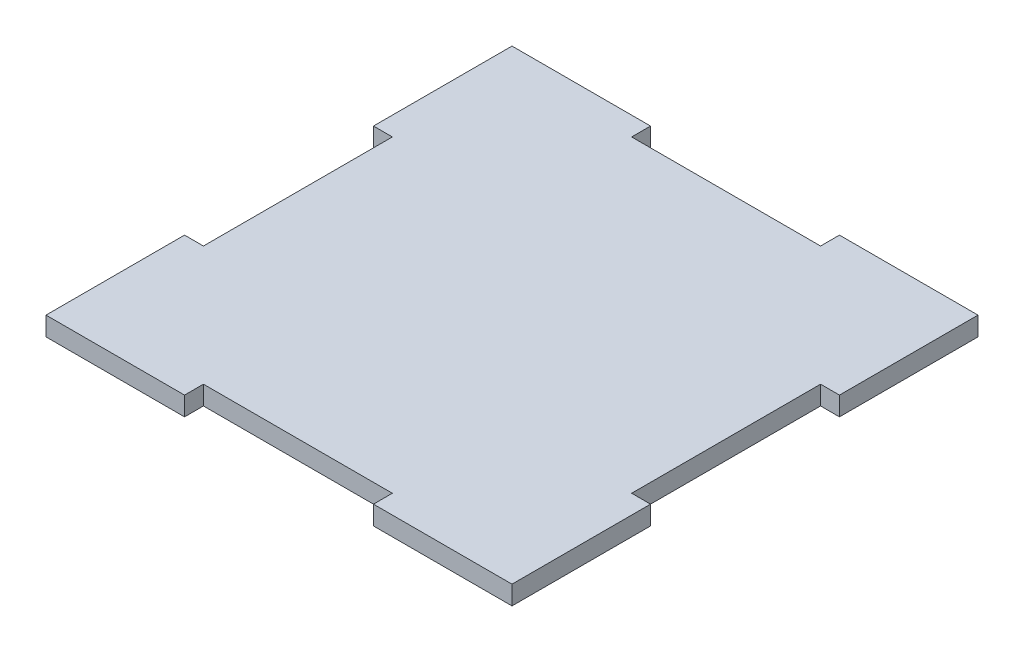
ISO-10303-21;
HEADER;
FILE_DESCRIPTION(('STEP AP214'),'2;1');
FILE_NAME('part.step','',(''),(''),'','','');
FILE_SCHEMA(('AUTOMOTIVE_DESIGN { 1 0 10303 214 1 1 1 1 }'));
ENDSEC;
DATA;
#1=APPLICATION_CONTEXT('core data for automotive mechanical design processes');
#2=APPLICATION_PROTOCOL_DEFINITION('international standard','automotive_design',2000,#1);
#3=PRODUCT_CONTEXT('',#1,'mechanical');
#4=PRODUCT('Part','Part','',(#3));
#5=PRODUCT_RELATED_PRODUCT_CATEGORY('part','',(#4));
#6=PRODUCT_DEFINITION_FORMATION('','',#4);
#7=PRODUCT_DEFINITION_CONTEXT('part definition',#1,'design');
#8=PRODUCT_DEFINITION('design','',#6,#7);
#9=PRODUCT_DEFINITION_SHAPE('','',#8);
#10=(LENGTH_UNIT() NAMED_UNIT(*) SI_UNIT(.MILLI.,.METRE.));
#11=(NAMED_UNIT(*) PLANE_ANGLE_UNIT() SI_UNIT($,.RADIAN.));
#12=(NAMED_UNIT(*) SI_UNIT($,.STERADIAN.) SOLID_ANGLE_UNIT());
#13=UNCERTAINTY_MEASURE_WITH_UNIT(LENGTH_MEASURE(1.E-05),#10,'distance_accuracy_value','');
#14=(GEOMETRIC_REPRESENTATION_CONTEXT(3) GLOBAL_UNCERTAINTY_ASSIGNED_CONTEXT((#13)) GLOBAL_UNIT_ASSIGNED_CONTEXT((#10,
#11,#12)) REPRESENTATION_CONTEXT('',''));
#15=CARTESIAN_POINT('',(0.,0.,0.));
#16=DIRECTION('',(0.,0.,1.));
#17=DIRECTION('',(1.,0.,0.));
#18=AXIS2_PLACEMENT_3D('',#15,#16,#17);
#19=CARTESIAN_POINT('',(37.,3.,-37.));
#20=DIRECTION('',(-1.,0.,0.));
#21=DIRECTION('',(0.,0.,1.));
#22=AXIS2_PLACEMENT_3D('',#19,#20,#21);
#23=PLANE('',#22);
#24=DIRECTION('',(0.,0.,-1.));
#25=VECTOR('',#24,1.);
#26=CARTESIAN_POINT('',(37.,0.,-37.));
#27=LINE('',#26,#25);
#28=CARTESIAN_POINT('',(37.,0.,37.));
#29=VERTEX_POINT('',#28);
#30=CARTESIAN_POINT('',(37.,0.,15.));
#31=VERTEX_POINT('',#30);
#32=EDGE_CURVE('E305',#29,#31,#27,.T.);
#33=ORIENTED_EDGE('',*,*,#32,.T.);
#34=DIRECTION('',(0.,1.,0.));
#35=VECTOR('',#34,1.);
#36=CARTESIAN_POINT('',(37.,0.,15.));
#37=LINE('',#36,#35);
#38=CARTESIAN_POINT('',(37.,3.,15.));
#39=VERTEX_POINT('',#38);
#40=EDGE_CURVE('E220',#31,#39,#37,.T.);
#41=ORIENTED_EDGE('',*,*,#40,.T.);
#42=DIRECTION('',(0.,0.,-1.));
#43=VECTOR('',#42,1.);
#44=CARTESIAN_POINT('',(37.,3.,-37.));
#45=LINE('',#44,#43);
#46=CARTESIAN_POINT('',(37.,3.,37.));
#47=VERTEX_POINT('',#46);
#48=EDGE_CURVE('E288',#47,#39,#45,.T.);
#49=ORIENTED_EDGE('',*,*,#48,.F.);
#50=DIRECTION('',(0.,-1.,0.));
#51=VECTOR('',#50,1.);
#52=CARTESIAN_POINT('',(37.,3.,37.));
#53=LINE('',#52,#51);
#54=EDGE_CURVE('E304',#47,#29,#53,.T.);
#55=ORIENTED_EDGE('',*,*,#54,.T.);
#56=EDGE_LOOP('',(#33,#41,#49,#55));
#57=FACE_BOUND('',#56,.T.);
#58=ADVANCED_FACE('F39',(#57),#23,.F.);
#59=CARTESIAN_POINT('',(-37.,3.,-37.));
#60=DIRECTION('',(0.,0.,1.));
#61=DIRECTION('',(1.,0.,0.));
#62=AXIS2_PLACEMENT_3D('',#59,#60,#61);
#63=PLANE('',#62);
#64=DIRECTION('',(-1.,0.,0.));
#65=VECTOR('',#64,1.);
#66=CARTESIAN_POINT('',(-37.,3.,-37.));
#67=LINE('',#66,#65);
#68=CARTESIAN_POINT('',(-15.,3.,-37.));
#69=VERTEX_POINT('',#68);
#70=CARTESIAN_POINT('',(-37.,3.,-37.));
#71=VERTEX_POINT('',#70);
#72=EDGE_CURVE('E291',#69,#71,#67,.T.);
#73=ORIENTED_EDGE('',*,*,#72,.F.);
#74=DIRECTION('',(0.,1.,0.));
#75=VECTOR('',#74,1.);
#76=CARTESIAN_POINT('',(-15.,0.,-37.));
#77=LINE('',#76,#75);
#78=CARTESIAN_POINT('',(-15.,0.,-37.));
#79=VERTEX_POINT('',#78);
#80=EDGE_CURVE('E206',#79,#69,#77,.T.);
#81=ORIENTED_EDGE('',*,*,#80,.F.);
#82=DIRECTION('',(-1.,0.,0.));
#83=VECTOR('',#82,1.);
#84=CARTESIAN_POINT('',(-37.,0.,-37.));
#85=LINE('',#84,#83);
#86=CARTESIAN_POINT('',(-37.,0.,-37.));
#87=VERTEX_POINT('',#86);
#88=EDGE_CURVE('E196',#79,#87,#85,.T.);
#89=ORIENTED_EDGE('',*,*,#88,.T.);
#90=DIRECTION('',(0.,-1.,0.));
#91=VECTOR('',#90,1.);
#92=CARTESIAN_POINT('',(-37.,3.,-37.));
#93=LINE('',#92,#91);
#94=EDGE_CURVE('E47',#71,#87,#93,.T.);
#95=ORIENTED_EDGE('',*,*,#94,.F.);
#96=EDGE_LOOP('',(#73,#81,#89,#95));
#97=FACE_BOUND('',#96,.T.);
#98=ADVANCED_FACE('F337',(#97),#63,.F.);
#99=CARTESIAN_POINT('',(-37.,3.,-37.));
#100=DIRECTION('',(1.,0.,0.));
#101=DIRECTION('',(0.,0.,-1.));
#102=AXIS2_PLACEMENT_3D('',#99,#100,#101);
#103=PLANE('',#102);
#104=DIRECTION('',(0.,0.,1.));
#105=VECTOR('',#104,1.);
#106=CARTESIAN_POINT('',(-37.,0.,-37.));
#107=LINE('',#106,#105);
#108=CARTESIAN_POINT('',(-37.,0.,-15.));
#109=VERTEX_POINT('',#108);
#110=EDGE_CURVE('E312',#87,#109,#107,.T.);
#111=ORIENTED_EDGE('',*,*,#110,.T.);
#112=DIRECTION('',(0.,1.,0.));
#113=VECTOR('',#112,1.);
#114=CARTESIAN_POINT('',(-37.,0.,-15.));
#115=LINE('',#114,#113);
#116=CARTESIAN_POINT('',(-37.,3.,-15.));
#117=VERTEX_POINT('',#116);
#118=EDGE_CURVE('E270',#109,#117,#115,.T.);
#119=ORIENTED_EDGE('',*,*,#118,.T.);
#120=DIRECTION('',(0.,0.,1.));
#121=VECTOR('',#120,1.);
#122=CARTESIAN_POINT('',(-37.,3.,-37.));
#123=LINE('',#122,#121);
#124=EDGE_CURVE('E297',#71,#117,#123,.T.);
#125=ORIENTED_EDGE('',*,*,#124,.F.);
#126=ORIENTED_EDGE('',*,*,#94,.T.);
#127=EDGE_LOOP('',(#111,#119,#125,#126));
#128=FACE_BOUND('',#127,.T.);
#129=ADVANCED_FACE('F327',(#128),#103,.F.);
#130=CARTESIAN_POINT('',(-37.,3.,37.));
#131=DIRECTION('',(0.,0.,-1.));
#132=DIRECTION('',(-1.,0.,0.));
#133=AXIS2_PLACEMENT_3D('',#130,#131,#132);
#134=PLANE('',#133);
#135=DIRECTION('',(1.,0.,0.));
#136=VECTOR('',#135,1.);
#137=CARTESIAN_POINT('',(-37.,0.,37.));
#138=LINE('',#137,#136);
#139=CARTESIAN_POINT('',(-37.,0.,37.));
#140=VERTEX_POINT('',#139);
#141=CARTESIAN_POINT('',(-15.,0.,37.));
#142=VERTEX_POINT('',#141);
#143=EDGE_CURVE('E316',#140,#142,#138,.T.);
#144=ORIENTED_EDGE('',*,*,#143,.T.);
#145=DIRECTION('',(0.,1.,0.));
#146=VECTOR('',#145,1.);
#147=CARTESIAN_POINT('',(-15.,0.,37.));
#148=LINE('',#147,#146);
#149=CARTESIAN_POINT('',(-15.,3.,37.));
#150=VERTEX_POINT('',#149);
#151=EDGE_CURVE('E237',#142,#150,#148,.T.);
#152=ORIENTED_EDGE('',*,*,#151,.T.);
#153=DIRECTION('',(1.,0.,0.));
#154=VECTOR('',#153,1.);
#155=CARTESIAN_POINT('',(-37.,3.,37.));
#156=LINE('',#155,#154);
#157=CARTESIAN_POINT('',(-37.,3.,37.));
#158=VERTEX_POINT('',#157);
#159=EDGE_CURVE('E301',#158,#150,#156,.T.);
#160=ORIENTED_EDGE('',*,*,#159,.F.);
#161=DIRECTION('',(0.,-1.,0.));
#162=VECTOR('',#161,1.);
#163=CARTESIAN_POINT('',(-37.,3.,37.));
#164=LINE('',#163,#162);
#165=EDGE_CURVE('E321',#158,#140,#164,.T.);
#166=ORIENTED_EDGE('',*,*,#165,.T.);
#167=EDGE_LOOP('',(#144,#152,#160,#166));
#168=FACE_BOUND('',#167,.T.);
#169=ADVANCED_FACE('F344',(#168),#134,.F.);
#170=CARTESIAN_POINT('',(37.,3.,-15.));
#171=VERTEX_POINT('',#170);
#172=CARTESIAN_POINT('',(37.,3.,-37.));
#173=VERTEX_POINT('',#172);
#174=EDGE_CURVE('E292',#171,#173,#45,.T.);
#175=ORIENTED_EDGE('',*,*,#174,.F.);
#176=DIRECTION('',(0.,1.,0.));
#177=VECTOR('',#176,1.);
#178=CARTESIAN_POINT('',(37.,0.,-15.));
#179=LINE('',#178,#177);
#180=CARTESIAN_POINT('',(37.,0.,-15.));
#181=VERTEX_POINT('',#180);
#182=EDGE_CURVE('E213',#181,#171,#179,.T.);
#183=ORIENTED_EDGE('',*,*,#182,.F.);
#184=CARTESIAN_POINT('',(37.,0.,-37.));
#185=VERTEX_POINT('',#184);
#186=EDGE_CURVE('E208',#181,#185,#27,.T.);
#187=ORIENTED_EDGE('',*,*,#186,.T.);
#188=DIRECTION('',(0.,-1.,0.));
#189=VECTOR('',#188,1.);
#190=CARTESIAN_POINT('',(37.,3.,-37.));
#191=LINE('',#190,#189);
#192=EDGE_CURVE('E11',#173,#185,#191,.T.);
#193=ORIENTED_EDGE('',*,*,#192,.F.);
#194=EDGE_LOOP('',(#175,#183,#187,#193));
#195=FACE_BOUND('',#194,.T.);
#196=ADVANCED_FACE('F41',(#195),#23,.F.);
#197=CARTESIAN_POINT('',(15.,0.,-37.));
#198=VERTEX_POINT('',#197);
#199=EDGE_CURVE('E308',#185,#198,#85,.T.);
#200=ORIENTED_EDGE('',*,*,#199,.T.);
#201=DIRECTION('',(0.,1.,0.));
#202=VECTOR('',#201,1.);
#203=CARTESIAN_POINT('',(15.,0.,-37.));
#204=LINE('',#203,#202);
#205=CARTESIAN_POINT('',(15.,3.,-37.));
#206=VERTEX_POINT('',#205);
#207=EDGE_CURVE('E209',#198,#206,#204,.T.);
#208=ORIENTED_EDGE('',*,*,#207,.T.);
#209=EDGE_CURVE('E293',#173,#206,#67,.T.);
#210=ORIENTED_EDGE('',*,*,#209,.F.);
#211=ORIENTED_EDGE('',*,*,#192,.T.);
#212=EDGE_LOOP('',(#200,#208,#210,#211));
#213=FACE_BOUND('',#212,.T.);
#214=ADVANCED_FACE('F339',(#213),#63,.F.);
#215=CARTESIAN_POINT('',(-37.,3.,15.));
#216=VERTEX_POINT('',#215);
#217=EDGE_CURVE('E296',#216,#158,#123,.T.);
#218=ORIENTED_EDGE('',*,*,#217,.F.);
#219=DIRECTION('',(0.,1.,0.));
#220=VECTOR('',#219,1.);
#221=CARTESIAN_POINT('',(-37.,0.,15.));
#222=LINE('',#221,#220);
#223=CARTESIAN_POINT('',(-37.,0.,15.));
#224=VERTEX_POINT('',#223);
#225=EDGE_CURVE('E263',#224,#216,#222,.T.);
#226=ORIENTED_EDGE('',*,*,#225,.F.);
#227=EDGE_CURVE('E311',#224,#140,#107,.T.);
#228=ORIENTED_EDGE('',*,*,#227,.T.);
#229=ORIENTED_EDGE('',*,*,#165,.F.);
#230=EDGE_LOOP('',(#218,#226,#228,#229));
#231=FACE_BOUND('',#230,.T.);
#232=ADVANCED_FACE('F346',(#231),#103,.F.);
#233=CARTESIAN_POINT('',(15.,3.,37.));
#234=VERTEX_POINT('',#233);
#235=EDGE_CURVE('E300',#234,#47,#156,.T.);
#236=ORIENTED_EDGE('',*,*,#235,.F.);
#237=DIRECTION('',(0.,1.,0.));
#238=VECTOR('',#237,1.);
#239=CARTESIAN_POINT('',(15.,0.,37.));
#240=LINE('',#239,#238);
#241=CARTESIAN_POINT('',(15.,0.,37.));
#242=VERTEX_POINT('',#241);
#243=EDGE_CURVE('E241',#242,#234,#240,.T.);
#244=ORIENTED_EDGE('',*,*,#243,.F.);
#245=EDGE_CURVE('E315',#242,#29,#138,.T.);
#246=ORIENTED_EDGE('',*,*,#245,.T.);
#247=ORIENTED_EDGE('',*,*,#54,.F.);
#248=EDGE_LOOP('',(#236,#244,#246,#247));
#249=FACE_BOUND('',#248,.T.);
#250=ADVANCED_FACE('F354',(#249),#134,.F.);
#251=CARTESIAN_POINT('',(0.,3.,0.));
#252=DIRECTION('',(0.,1.,0.));
#253=DIRECTION('',(0.,0.,1.));
#254=AXIS2_PLACEMENT_3D('',#251,#252,#253);
#255=PLANE('',#254);
#256=DIRECTION('',(0.,0.,1.));
#257=VECTOR('',#256,1.);
#258=CARTESIAN_POINT('',(-15.,3.,-37.));
#259=LINE('',#258,#257);
#260=CARTESIAN_POINT('',(-15.,3.,-34.));
#261=VERTEX_POINT('',#260);
#262=EDGE_CURVE('E182',#69,#261,#259,.T.);
#263=ORIENTED_EDGE('',*,*,#262,.F.);
#264=ORIENTED_EDGE('',*,*,#72,.T.);
#265=ORIENTED_EDGE('',*,*,#124,.T.);
#266=DIRECTION('',(-1.,0.,0.));
#267=VECTOR('',#266,1.);
#268=CARTESIAN_POINT('',(-37.,3.,-15.));
#269=LINE('',#268,#267);
#270=CARTESIAN_POINT('',(-34.,3.,-15.));
#271=VERTEX_POINT('',#270);
#272=EDGE_CURVE('E273',#271,#117,#269,.T.);
#273=ORIENTED_EDGE('',*,*,#272,.F.);
#274=DIRECTION('',(0.,0.,-1.));
#275=VECTOR('',#274,1.);
#276=CARTESIAN_POINT('',(-34.,3.,-15.));
#277=LINE('',#276,#275);
#278=CARTESIAN_POINT('',(-34.,3.,15.));
#279=VERTEX_POINT('',#278);
#280=EDGE_CURVE('E275',#279,#271,#277,.T.);
#281=ORIENTED_EDGE('',*,*,#280,.F.);
#282=DIRECTION('',(1.,0.,0.));
#283=VECTOR('',#282,1.);
#284=CARTESIAN_POINT('',(-37.,3.,15.));
#285=LINE('',#284,#283);
#286=EDGE_CURVE('E247',#216,#279,#285,.T.);
#287=ORIENTED_EDGE('',*,*,#286,.F.);
#288=ORIENTED_EDGE('',*,*,#217,.T.);
#289=ORIENTED_EDGE('',*,*,#159,.T.);
#290=DIRECTION('',(0.,0.,1.));
#291=VECTOR('',#290,1.);
#292=CARTESIAN_POINT('',(-15.,3.,37.));
#293=LINE('',#292,#291);
#294=CARTESIAN_POINT('',(-15.,3.,34.));
#295=VERTEX_POINT('',#294);
#296=EDGE_CURVE('E223',#295,#150,#293,.T.);
#297=ORIENTED_EDGE('',*,*,#296,.F.);
#298=DIRECTION('',(-1.,0.,0.));
#299=VECTOR('',#298,1.);
#300=CARTESIAN_POINT('',(-15.,3.,34.));
#301=LINE('',#300,#299);
#302=CARTESIAN_POINT('',(15.,3.,34.));
#303=VERTEX_POINT('',#302);
#304=EDGE_CURVE('E248',#303,#295,#301,.T.);
#305=ORIENTED_EDGE('',*,*,#304,.F.);
#306=DIRECTION('',(0.,0.,-1.));
#307=VECTOR('',#306,1.);
#308=CARTESIAN_POINT('',(15.,3.,37.));
#309=LINE('',#308,#307);
#310=EDGE_CURVE('E251',#234,#303,#309,.T.);
#311=ORIENTED_EDGE('',*,*,#310,.F.);
#312=ORIENTED_EDGE('',*,*,#235,.T.);
#313=ORIENTED_EDGE('',*,*,#48,.T.);
#314=DIRECTION('',(1.,0.,0.));
#315=VECTOR('',#314,1.);
#316=CARTESIAN_POINT('',(37.,3.,15.));
#317=LINE('',#316,#315);
#318=CARTESIAN_POINT('',(34.,3.,15.));
#319=VERTEX_POINT('',#318);
#320=EDGE_CURVE('E224',#319,#39,#317,.T.);
#321=ORIENTED_EDGE('',*,*,#320,.F.);
#322=DIRECTION('',(0.,0.,1.));
#323=VECTOR('',#322,1.);
#324=CARTESIAN_POINT('',(34.,3.,-15.));
#325=LINE('',#324,#323);
#326=CARTESIAN_POINT('',(34.,3.,-15.));
#327=VERTEX_POINT('',#326);
#328=EDGE_CURVE('E226',#327,#319,#325,.T.);
#329=ORIENTED_EDGE('',*,*,#328,.F.);
#330=DIRECTION('',(-1.,0.,0.));
#331=VECTOR('',#330,1.);
#332=CARTESIAN_POINT('',(37.,3.,-15.));
#333=LINE('',#332,#331);
#334=EDGE_CURVE('E204',#171,#327,#333,.T.);
#335=ORIENTED_EDGE('',*,*,#334,.F.);
#336=ORIENTED_EDGE('',*,*,#174,.T.);
#337=ORIENTED_EDGE('',*,*,#209,.T.);
#338=DIRECTION('',(0.,0.,-1.));
#339=VECTOR('',#338,1.);
#340=CARTESIAN_POINT('',(15.,3.,-37.));
#341=LINE('',#340,#339);
#342=CARTESIAN_POINT('',(15.,3.,-34.));
#343=VERTEX_POINT('',#342);
#344=EDGE_CURVE('E197',#343,#206,#341,.T.);
#345=ORIENTED_EDGE('',*,*,#344,.F.);
#346=DIRECTION('',(1.,0.,0.));
#347=VECTOR('',#346,1.);
#348=CARTESIAN_POINT('',(-15.,3.,-34.));
#349=LINE('',#348,#347);
#350=EDGE_CURVE('E199',#261,#343,#349,.T.);
#351=ORIENTED_EDGE('',*,*,#350,.F.);
#352=EDGE_LOOP('',(#263,#264,#265,#273,#281,#287,#288,#289,#297,#305,#311,#312,#313,#321,#329,
#335,#336,#337,#345,#351));
#353=FACE_BOUND('',#352,.T.);
#354=ADVANCED_FACE('F335',(#353),#255,.T.);
#355=CARTESIAN_POINT('',(0.,0.,0.));
#356=DIRECTION('',(0.,1.,0.));
#357=DIRECTION('',(0.,0.,1.));
#358=AXIS2_PLACEMENT_3D('',#355,#356,#357);
#359=PLANE('',#358);
#360=ORIENTED_EDGE('',*,*,#88,.F.);
#361=DIRECTION('',(0.,0.,1.));
#362=VECTOR('',#361,1.);
#363=CARTESIAN_POINT('',(-15.,0.,-37.));
#364=LINE('',#363,#362);
#365=CARTESIAN_POINT('',(-15.,0.,-34.));
#366=VERTEX_POINT('',#365);
#367=EDGE_CURVE('E179',#79,#366,#364,.T.);
#368=ORIENTED_EDGE('',*,*,#367,.T.);
#369=DIRECTION('',(1.,0.,0.));
#370=VECTOR('',#369,1.);
#371=CARTESIAN_POINT('',(-15.,0.,-34.));
#372=LINE('',#371,#370);
#373=CARTESIAN_POINT('',(15.,0.,-34.));
#374=VERTEX_POINT('',#373);
#375=EDGE_CURVE('E189',#366,#374,#372,.T.);
#376=ORIENTED_EDGE('',*,*,#375,.T.);
#377=DIRECTION('',(0.,0.,-1.));
#378=VECTOR('',#377,1.);
#379=CARTESIAN_POINT('',(15.,0.,-37.));
#380=LINE('',#379,#378);
#381=EDGE_CURVE('E54',#374,#198,#380,.T.);
#382=ORIENTED_EDGE('',*,*,#381,.T.);
#383=ORIENTED_EDGE('',*,*,#199,.F.);
#384=ORIENTED_EDGE('',*,*,#186,.F.);
#385=DIRECTION('',(-1.,0.,0.));
#386=VECTOR('',#385,1.);
#387=CARTESIAN_POINT('',(37.,0.,-15.));
#388=LINE('',#387,#386);
#389=CARTESIAN_POINT('',(34.,0.,-15.));
#390=VERTEX_POINT('',#389);
#391=EDGE_CURVE('E227',#181,#390,#388,.T.);
#392=ORIENTED_EDGE('',*,*,#391,.T.);
#393=DIRECTION('',(0.,0.,1.));
#394=VECTOR('',#393,1.);
#395=CARTESIAN_POINT('',(34.,0.,-15.));
#396=LINE('',#395,#394);
#397=CARTESIAN_POINT('',(34.,0.,15.));
#398=VERTEX_POINT('',#397);
#399=EDGE_CURVE('E62',#390,#398,#396,.T.);
#400=ORIENTED_EDGE('',*,*,#399,.T.);
#401=DIRECTION('',(1.,0.,0.));
#402=VECTOR('',#401,1.);
#403=CARTESIAN_POINT('',(37.,0.,15.));
#404=LINE('',#403,#402);
#405=EDGE_CURVE('E215',#398,#31,#404,.T.);
#406=ORIENTED_EDGE('',*,*,#405,.T.);
#407=ORIENTED_EDGE('',*,*,#32,.F.);
#408=ORIENTED_EDGE('',*,*,#245,.F.);
#409=DIRECTION('',(0.,0.,-1.));
#410=VECTOR('',#409,1.);
#411=CARTESIAN_POINT('',(15.,0.,37.));
#412=LINE('',#411,#410);
#413=CARTESIAN_POINT('',(15.,0.,34.));
#414=VERTEX_POINT('',#413);
#415=EDGE_CURVE('E258',#242,#414,#412,.T.);
#416=ORIENTED_EDGE('',*,*,#415,.T.);
#417=DIRECTION('',(-1.,0.,0.));
#418=VECTOR('',#417,1.);
#419=CARTESIAN_POINT('',(-15.,0.,34.));
#420=LINE('',#419,#418);
#421=CARTESIAN_POINT('',(-15.,0.,34.));
#422=VERTEX_POINT('',#421);
#423=EDGE_CURVE('E240',#414,#422,#420,.T.);
#424=ORIENTED_EDGE('',*,*,#423,.T.);
#425=DIRECTION('',(0.,0.,1.));
#426=VECTOR('',#425,1.);
#427=CARTESIAN_POINT('',(-15.,0.,37.));
#428=LINE('',#427,#426);
#429=EDGE_CURVE('E252',#422,#142,#428,.T.);
#430=ORIENTED_EDGE('',*,*,#429,.T.);
#431=ORIENTED_EDGE('',*,*,#143,.F.);
#432=ORIENTED_EDGE('',*,*,#227,.F.);
#433=DIRECTION('',(1.,0.,0.));
#434=VECTOR('',#433,1.);
#435=CARTESIAN_POINT('',(-37.,0.,15.));
#436=LINE('',#435,#434);
#437=CARTESIAN_POINT('',(-34.,0.,15.));
#438=VERTEX_POINT('',#437);
#439=EDGE_CURVE('E276',#224,#438,#436,.T.);
#440=ORIENTED_EDGE('',*,*,#439,.T.);
#441=DIRECTION('',(0.,0.,-1.));
#442=VECTOR('',#441,1.);
#443=CARTESIAN_POINT('',(-34.,0.,-15.));
#444=LINE('',#443,#442);
#445=CARTESIAN_POINT('',(-34.,0.,-15.));
#446=VERTEX_POINT('',#445);
#447=EDGE_CURVE('E283',#438,#446,#444,.T.);
#448=ORIENTED_EDGE('',*,*,#447,.T.);
#449=DIRECTION('',(-1.,0.,0.));
#450=VECTOR('',#449,1.);
#451=CARTESIAN_POINT('',(-37.,0.,-15.));
#452=LINE('',#451,#450);
#453=EDGE_CURVE('E265',#446,#109,#452,.T.);
#454=ORIENTED_EDGE('',*,*,#453,.T.);
#455=ORIENTED_EDGE('',*,*,#110,.F.);
#456=EDGE_LOOP('',(#360,#368,#376,#382,#383,#384,#392,#400,#406,#407,#408,#416,#424,#430,#431,
#432,#440,#448,#454,#455));
#457=FACE_BOUND('',#456,.T.);
#458=ADVANCED_FACE('F194',(#457),#359,.F.);
#459=CARTESIAN_POINT('',(-37.,0.,-15.));
#460=DIRECTION('',(0.,0.,-1.));
#461=DIRECTION('',(-1.,0.,0.));
#462=AXIS2_PLACEMENT_3D('',#459,#460,#461);
#463=PLANE('',#462);
#464=ORIENTED_EDGE('',*,*,#272,.T.);
#465=ORIENTED_EDGE('',*,*,#118,.F.);
#466=ORIENTED_EDGE('',*,*,#453,.F.);
#467=DIRECTION('',(0.,1.,0.));
#468=VECTOR('',#467,1.);
#469=CARTESIAN_POINT('',(-34.,0.,-15.));
#470=LINE('',#469,#468);
#471=EDGE_CURVE('E268',#446,#271,#470,.T.);
#472=ORIENTED_EDGE('',*,*,#471,.T.);
#473=EDGE_LOOP('',(#464,#465,#466,#472));
#474=FACE_BOUND('',#473,.T.);
#475=ADVANCED_FACE('F332',(#474),#463,.F.);
#476=CARTESIAN_POINT('',(-34.,0.,-15.));
#477=DIRECTION('',(1.,0.,0.));
#478=DIRECTION('',(0.,0.,-1.));
#479=AXIS2_PLACEMENT_3D('',#476,#477,#478);
#480=PLANE('',#479);
#481=ORIENTED_EDGE('',*,*,#280,.T.);
#482=ORIENTED_EDGE('',*,*,#471,.F.);
#483=ORIENTED_EDGE('',*,*,#447,.F.);
#484=DIRECTION('',(0.,1.,0.));
#485=VECTOR('',#484,1.);
#486=CARTESIAN_POINT('',(-34.,0.,15.));
#487=LINE('',#486,#485);
#488=EDGE_CURVE('E266',#438,#279,#487,.T.);
#489=ORIENTED_EDGE('',*,*,#488,.T.);
#490=EDGE_LOOP('',(#481,#482,#483,#489));
#491=FACE_BOUND('',#490,.T.);
#492=ADVANCED_FACE('F402',(#491),#480,.F.);
#493=CARTESIAN_POINT('',(-37.,0.,15.));
#494=DIRECTION('',(0.,0.,1.));
#495=DIRECTION('',(1.,0.,0.));
#496=AXIS2_PLACEMENT_3D('',#493,#494,#495);
#497=PLANE('',#496);
#498=ORIENTED_EDGE('',*,*,#286,.T.);
#499=ORIENTED_EDGE('',*,*,#488,.F.);
#500=ORIENTED_EDGE('',*,*,#439,.F.);
#501=ORIENTED_EDGE('',*,*,#225,.T.);
#502=EDGE_LOOP('',(#498,#499,#500,#501));
#503=FACE_BOUND('',#502,.T.);
#504=ADVANCED_FACE('F399',(#503),#497,.F.);
#505=CARTESIAN_POINT('',(-15.,0.,37.));
#506=DIRECTION('',(-1.,0.,0.));
#507=DIRECTION('',(0.,0.,1.));
#508=AXIS2_PLACEMENT_3D('',#505,#506,#507);
#509=PLANE('',#508);
#510=ORIENTED_EDGE('',*,*,#296,.T.);
#511=ORIENTED_EDGE('',*,*,#151,.F.);
#512=ORIENTED_EDGE('',*,*,#429,.F.);
#513=DIRECTION('',(0.,1.,0.));
#514=VECTOR('',#513,1.);
#515=CARTESIAN_POINT('',(-15.,0.,34.));
#516=LINE('',#515,#514);
#517=EDGE_CURVE('E245',#422,#295,#516,.T.);
#518=ORIENTED_EDGE('',*,*,#517,.T.);
#519=EDGE_LOOP('',(#510,#511,#512,#518));
#520=FACE_BOUND('',#519,.T.);
#521=ADVANCED_FACE('F389',(#520),#509,.F.);
#522=CARTESIAN_POINT('',(-15.,0.,34.));
#523=DIRECTION('',(0.,0.,-1.));
#524=DIRECTION('',(-1.,0.,0.));
#525=AXIS2_PLACEMENT_3D('',#522,#523,#524);
#526=PLANE('',#525);
#527=ORIENTED_EDGE('',*,*,#304,.T.);
#528=ORIENTED_EDGE('',*,*,#517,.F.);
#529=ORIENTED_EDGE('',*,*,#423,.F.);
#530=DIRECTION('',(0.,1.,0.));
#531=VECTOR('',#530,1.);
#532=CARTESIAN_POINT('',(15.,0.,34.));
#533=LINE('',#532,#531);
#534=EDGE_CURVE('E243',#414,#303,#533,.T.);
#535=ORIENTED_EDGE('',*,*,#534,.T.);
#536=EDGE_LOOP('',(#527,#528,#529,#535));
#537=FACE_BOUND('',#536,.T.);
#538=ADVANCED_FACE('F385',(#537),#526,.F.);
#539=CARTESIAN_POINT('',(15.,0.,37.));
#540=DIRECTION('',(1.,0.,0.));
#541=DIRECTION('',(0.,0.,-1.));
#542=AXIS2_PLACEMENT_3D('',#539,#540,#541);
#543=PLANE('',#542);
#544=ORIENTED_EDGE('',*,*,#310,.T.);
#545=ORIENTED_EDGE('',*,*,#534,.F.);
#546=ORIENTED_EDGE('',*,*,#415,.F.);
#547=ORIENTED_EDGE('',*,*,#243,.T.);
#548=EDGE_LOOP('',(#544,#545,#546,#547));
#549=FACE_BOUND('',#548,.T.);
#550=ADVANCED_FACE('F381',(#549),#543,.F.);
#551=CARTESIAN_POINT('',(37.,0.,15.));
#552=DIRECTION('',(0.,0.,1.));
#553=DIRECTION('',(1.,0.,0.));
#554=AXIS2_PLACEMENT_3D('',#551,#552,#553);
#555=PLANE('',#554);
#556=ORIENTED_EDGE('',*,*,#320,.T.);
#557=ORIENTED_EDGE('',*,*,#40,.F.);
#558=ORIENTED_EDGE('',*,*,#405,.F.);
#559=DIRECTION('',(0.,1.,0.));
#560=VECTOR('',#559,1.);
#561=CARTESIAN_POINT('',(34.,0.,15.));
#562=LINE('',#561,#560);
#563=EDGE_CURVE('E218',#398,#319,#562,.T.);
#564=ORIENTED_EDGE('',*,*,#563,.T.);
#565=EDGE_LOOP('',(#556,#557,#558,#564));
#566=FACE_BOUND('',#565,.T.);
#567=ADVANCED_FACE('F371',(#566),#555,.F.);
#568=CARTESIAN_POINT('',(34.,0.,-15.));
#569=DIRECTION('',(-1.,0.,0.));
#570=DIRECTION('',(0.,0.,1.));
#571=AXIS2_PLACEMENT_3D('',#568,#569,#570);
#572=PLANE('',#571);
#573=ORIENTED_EDGE('',*,*,#328,.T.);
#574=ORIENTED_EDGE('',*,*,#563,.F.);
#575=ORIENTED_EDGE('',*,*,#399,.F.);
#576=DIRECTION('',(0.,1.,0.));
#577=VECTOR('',#576,1.);
#578=CARTESIAN_POINT('',(34.,0.,-15.));
#579=LINE('',#578,#577);
#580=EDGE_CURVE('E216',#390,#327,#579,.T.);
#581=ORIENTED_EDGE('',*,*,#580,.T.);
#582=EDGE_LOOP('',(#573,#574,#575,#581));
#583=FACE_BOUND('',#582,.T.);
#584=ADVANCED_FACE('F368',(#583),#572,.F.);
#585=CARTESIAN_POINT('',(37.,0.,-15.));
#586=DIRECTION('',(0.,0.,-1.));
#587=DIRECTION('',(-1.,0.,0.));
#588=AXIS2_PLACEMENT_3D('',#585,#586,#587);
#589=PLANE('',#588);
#590=ORIENTED_EDGE('',*,*,#334,.T.);
#591=ORIENTED_EDGE('',*,*,#580,.F.);
#592=ORIENTED_EDGE('',*,*,#391,.F.);
#593=ORIENTED_EDGE('',*,*,#182,.T.);
#594=EDGE_LOOP('',(#590,#591,#592,#593));
#595=FACE_BOUND('',#594,.T.);
#596=ADVANCED_FACE('F365',(#595),#589,.F.);
#597=CARTESIAN_POINT('',(-15.,0.,-37.));
#598=DIRECTION('',(-1.,0.,0.));
#599=DIRECTION('',(0.,0.,1.));
#600=AXIS2_PLACEMENT_3D('',#597,#598,#599);
#601=PLANE('',#600);
#602=ORIENTED_EDGE('',*,*,#262,.T.);
#603=DIRECTION('',(0.,1.,0.));
#604=VECTOR('',#603,1.);
#605=CARTESIAN_POINT('',(-15.,0.,-34.));
#606=LINE('',#605,#604);
#607=EDGE_CURVE('E175',#366,#261,#606,.T.);
#608=ORIENTED_EDGE('',*,*,#607,.F.);
#609=ORIENTED_EDGE('',*,*,#367,.F.);
#610=ORIENTED_EDGE('',*,*,#80,.T.);
#611=EDGE_LOOP('',(#602,#608,#609,#610));
#612=FACE_BOUND('',#611,.T.);
#613=ADVANCED_FACE('F177',(#612),#601,.F.);
#614=CARTESIAN_POINT('',(15.,0.,-37.));
#615=DIRECTION('',(1.,0.,0.));
#616=DIRECTION('',(0.,0.,-1.));
#617=AXIS2_PLACEMENT_3D('',#614,#615,#616);
#618=PLANE('',#617);
#619=ORIENTED_EDGE('',*,*,#344,.T.);
#620=ORIENTED_EDGE('',*,*,#207,.F.);
#621=ORIENTED_EDGE('',*,*,#381,.F.);
#622=DIRECTION('',(0.,1.,0.));
#623=VECTOR('',#622,1.);
#624=CARTESIAN_POINT('',(15.,0.,-34.));
#625=LINE('',#624,#623);
#626=EDGE_CURVE('E186',#374,#343,#625,.T.);
#627=ORIENTED_EDGE('',*,*,#626,.T.);
#628=EDGE_LOOP('',(#619,#620,#621,#627));
#629=FACE_BOUND('',#628,.T.);
#630=ADVANCED_FACE('F543',(#629),#618,.F.);
#631=CARTESIAN_POINT('',(-15.,0.,-34.));
#632=DIRECTION('',(0.,0.,1.));
#633=DIRECTION('',(1.,0.,0.));
#634=AXIS2_PLACEMENT_3D('',#631,#632,#633);
#635=PLANE('',#634);
#636=ORIENTED_EDGE('',*,*,#350,.T.);
#637=ORIENTED_EDGE('',*,*,#626,.F.);
#638=ORIENTED_EDGE('',*,*,#375,.F.);
#639=ORIENTED_EDGE('',*,*,#607,.T.);
#640=EDGE_LOOP('',(#636,#637,#638,#639));
#641=FACE_BOUND('',#640,.T.);
#642=ADVANCED_FACE('F190',(#641),#635,.F.);
#643=CLOSED_SHELL('',(#58,#98,#129,#169,#196,#214,#232,#250,#354,#458,#475,#492,#504,#521,#538,
#550,#567,#584,#596,#613,#630,#642));
#644=MANIFOLD_SOLID_BREP('B2',#643);
#645=ADVANCED_BREP_SHAPE_REPRESENTATION('',(#18,#644),#14);
#646=SHAPE_DEFINITION_REPRESENTATION(#9,#645);
ENDSEC;
END-ISO-10303-21;
